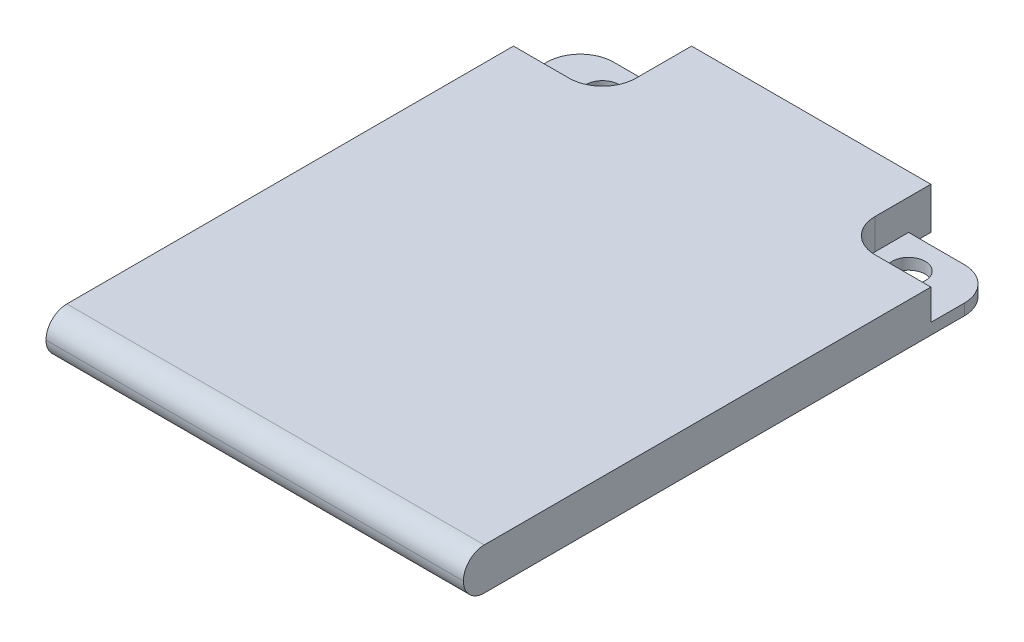
ISO-10303-21;
HEADER;
FILE_DESCRIPTION(('STEP AP214'),'2;1');
FILE_NAME('part.step','',(''),(''),'','','');
FILE_SCHEMA(('AUTOMOTIVE_DESIGN { 1 0 10303 214 1 1 1 1 }'));
ENDSEC;
DATA;
#1=APPLICATION_CONTEXT('core data for automotive mechanical design processes');
#2=APPLICATION_PROTOCOL_DEFINITION('international standard','automotive_design',2000,#1);
#3=PRODUCT_CONTEXT('',#1,'mechanical');
#4=PRODUCT('Part','Part','',(#3));
#5=PRODUCT_RELATED_PRODUCT_CATEGORY('part','',(#4));
#6=PRODUCT_DEFINITION_FORMATION('','',#4);
#7=PRODUCT_DEFINITION_CONTEXT('part definition',#1,'design');
#8=PRODUCT_DEFINITION('design','',#6,#7);
#9=PRODUCT_DEFINITION_SHAPE('','',#8);
#10=(LENGTH_UNIT() NAMED_UNIT(*) SI_UNIT(.MILLI.,.METRE.));
#11=(NAMED_UNIT(*) PLANE_ANGLE_UNIT() SI_UNIT($,.RADIAN.));
#12=(NAMED_UNIT(*) SI_UNIT($,.STERADIAN.) SOLID_ANGLE_UNIT());
#13=UNCERTAINTY_MEASURE_WITH_UNIT(LENGTH_MEASURE(1.E-05),#10,'distance_accuracy_value','');
#14=(GEOMETRIC_REPRESENTATION_CONTEXT(3) GLOBAL_UNCERTAINTY_ASSIGNED_CONTEXT((#13)) GLOBAL_UNIT_ASSIGNED_CONTEXT((#10,
#11,#12)) REPRESENTATION_CONTEXT('',''));
#15=CARTESIAN_POINT('',(0.,0.,0.));
#16=DIRECTION('',(0.,0.,1.));
#17=DIRECTION('',(1.,0.,0.));
#18=AXIS2_PLACEMENT_3D('',#15,#16,#17);
#19=CARTESIAN_POINT('',(37.5,3.75,-48.));
#20=DIRECTION('',(0.,0.,1.));
#21=DIRECTION('',(1.,0.,0.));
#22=AXIS2_PLACEMENT_3D('',#19,#20,#21);
#23=PLANE('',#22);
#24=DIRECTION('',(-1.,0.,0.));
#25=VECTOR('',#24,1.);
#26=CARTESIAN_POINT('',(29.5,1.,-48.));
#27=LINE('',#26,#25);
#28=CARTESIAN_POINT('',(34.5,1.,-48.));
#29=VERTEX_POINT('',#28);
#30=CARTESIAN_POINT('',(29.5,1.,-48.));
#31=VERTEX_POINT('',#30);
#32=EDGE_CURVE('E164',#29,#31,#27,.T.);
#33=ORIENTED_EDGE('',*,*,#32,.F.);
#34=DIRECTION('',(0.,-1.,0.));
#35=VECTOR('',#34,1.);
#36=CARTESIAN_POINT('',(34.5,3.75,-48.));
#37=LINE('',#36,#35);
#38=CARTESIAN_POINT('',(34.5,0.,-48.));
#39=VERTEX_POINT('',#38);
#40=EDGE_CURVE('E275',#29,#39,#37,.T.);
#41=ORIENTED_EDGE('',*,*,#40,.T.);
#42=DIRECTION('',(-1.,0.,0.));
#43=VECTOR('',#42,1.);
#44=CARTESIAN_POINT('',(37.5,0.,-48.));
#45=LINE('',#44,#43);
#46=CARTESIAN_POINT('',(29.5,0.,-48.));
#47=VERTEX_POINT('',#46);
#48=EDGE_CURVE('E242',#39,#47,#45,.T.);
#49=ORIENTED_EDGE('',*,*,#48,.T.);
#50=DIRECTION('',(0.,-1.,0.));
#51=VECTOR('',#50,1.);
#52=CARTESIAN_POINT('',(29.5,3.75,-48.));
#53=LINE('',#52,#51);
#54=EDGE_CURVE('E259',#31,#47,#53,.T.);
#55=ORIENTED_EDGE('',*,*,#54,.F.);
#56=EDGE_LOOP('',(#33,#41,#49,#55));
#57=FACE_BOUND('',#56,.T.);
#58=ADVANCED_FACE('F33',(#57),#23,.F.);
#59=CARTESIAN_POINT('',(32.5,3.75,-45.));
#60=DIRECTION('',(0.,-1.,0.));
#61=DIRECTION('',(0.,0.,-1.));
#62=AXIS2_PLACEMENT_3D('',#59,#60,#61);
#63=CYLINDRICAL_SURFACE('',#62,1.5);
#64=CARTESIAN_POINT('',(32.5,0.,-45.));
#65=DIRECTION('',(0.,1.,0.));
#66=DIRECTION('',(0.,0.,1.));
#67=AXIS2_PLACEMENT_3D('',#64,#65,#66);
#68=CIRCLE('',#67,1.5);
#69=CARTESIAN_POINT('',(32.5,0.,-43.5));
#70=VERTEX_POINT('',#69);
#71=EDGE_CURVE('E218',#70,#70,#68,.T.);
#72=ORIENTED_EDGE('',*,*,#71,.F.);
#73=EDGE_LOOP('',(#72));
#74=FACE_BOUND('',#73,.T.);
#75=CARTESIAN_POINT('',(32.5,1.,-45.));
#76=DIRECTION('',(0.,1.,0.));
#77=DIRECTION('',(0.,0.,1.));
#78=AXIS2_PLACEMENT_3D('',#75,#76,#77);
#79=CIRCLE('',#78,1.5);
#80=CARTESIAN_POINT('',(32.5,1.,-43.5));
#81=VERTEX_POINT('',#80);
#82=EDGE_CURVE('E190',#81,#81,#79,.T.);
#83=ORIENTED_EDGE('',*,*,#82,.T.);
#84=EDGE_LOOP('',(#83));
#85=FACE_BOUND('',#84,.T.);
#86=ADVANCED_FACE('F360',(#74,#85),#63,.F.);
#87=CARTESIAN_POINT('',(0.,3.75,0.));
#88=DIRECTION('',(0.,1.,0.));
#89=DIRECTION('',(0.,0.,1.));
#90=AXIS2_PLACEMENT_3D('',#87,#88,#89);
#91=PLANE('',#90);
#92=CARTESIAN_POINT('',(32.5,3.75,-45.));
#93=DIRECTION('',(0.,1.,0.));
#94=DIRECTION('',(0.,0.,1.));
#95=AXIS2_PLACEMENT_3D('',#92,#93,#94);
#96=CIRCLE('',#95,3.);
#97=CARTESIAN_POINT('',(29.5,3.75,-45.));
#98=VERTEX_POINT('',#97);
#99=CARTESIAN_POINT('',(32.5,3.75,-42.));
#100=VERTEX_POINT('',#99);
#101=EDGE_CURVE('E179',#98,#100,#96,.T.);
#102=ORIENTED_EDGE('',*,*,#101,.F.);
#103=DIRECTION('',(0.,0.,-1.));
#104=VECTOR('',#103,1.);
#105=CARTESIAN_POINT('',(29.5,3.75,-48.));
#106=LINE('',#105,#104);
#107=CARTESIAN_POINT('',(29.5,3.75,-50.));
#108=VERTEX_POINT('',#107);
#109=EDGE_CURVE('E159',#98,#108,#106,.T.);
#110=ORIENTED_EDGE('',*,*,#109,.T.);
#111=DIRECTION('',(-1.,0.,0.));
#112=VECTOR('',#111,1.);
#113=CARTESIAN_POINT('',(29.5,3.75,-50.));
#114=LINE('',#113,#112);
#115=CARTESIAN_POINT('',(8.,3.75,-50.));
#116=VERTEX_POINT('',#115);
#117=EDGE_CURVE('E233',#108,#116,#114,.T.);
#118=ORIENTED_EDGE('',*,*,#117,.T.);
#119=DIRECTION('',(0.,0.,1.));
#120=VECTOR('',#119,1.);
#121=CARTESIAN_POINT('',(8.,3.75,-50.));
#122=LINE('',#121,#120);
#123=CARTESIAN_POINT('',(8.,3.75,-45.));
#124=VERTEX_POINT('',#123);
#125=EDGE_CURVE('E235',#116,#124,#122,.T.);
#126=ORIENTED_EDGE('',*,*,#125,.T.);
#127=CARTESIAN_POINT('',(5.,3.75,-45.));
#128=DIRECTION('',(0.,1.,0.));
#129=DIRECTION('',(0.,0.,-1.));
#130=AXIS2_PLACEMENT_3D('',#127,#128,#129);
#131=CIRCLE('',#130,3.);
#132=CARTESIAN_POINT('',(4.99999999999998,3.75,-42.));
#133=VERTEX_POINT('',#132);
#134=EDGE_CURVE('E195',#133,#124,#131,.T.);
#135=ORIENTED_EDGE('',*,*,#134,.F.);
#136=DIRECTION('',(1.,0.,0.));
#137=VECTOR('',#136,1.);
#138=CARTESIAN_POINT('',(4.99999999999998,3.75,-42.));
#139=LINE('',#138,#137);
#140=CARTESIAN_POINT('',(0.,3.75,-42.));
#141=VERTEX_POINT('',#140);
#142=EDGE_CURVE('E206',#141,#133,#139,.T.);
#143=ORIENTED_EDGE('',*,*,#142,.F.);
#144=DIRECTION('',(0.,0.,1.));
#145=VECTOR('',#144,1.);
#146=CARTESIAN_POINT('',(0.,3.75,-48.));
#147=LINE('',#146,#145);
#148=CARTESIAN_POINT('',(0.,3.75,-1.875));
#149=VERTEX_POINT('',#148);
#150=EDGE_CURVE('E226',#141,#149,#147,.T.);
#151=ORIENTED_EDGE('',*,*,#150,.T.);
#152=DIRECTION('',(1.,0.,0.));
#153=VECTOR('',#152,1.);
#154=CARTESIAN_POINT('',(37.5,3.75,-1.875));
#155=LINE('',#154,#153);
#156=CARTESIAN_POINT('',(37.5,3.75,-1.875));
#157=VERTEX_POINT('',#156);
#158=EDGE_CURVE('E273',#149,#157,#155,.T.);
#159=ORIENTED_EDGE('',*,*,#158,.T.);
#160=DIRECTION('',(0.,0.,-1.));
#161=VECTOR('',#160,1.);
#162=CARTESIAN_POINT('',(37.5,3.75,0.));
#163=LINE('',#162,#161);
#164=CARTESIAN_POINT('',(37.5,3.75,-42.));
#165=VERTEX_POINT('',#164);
#166=EDGE_CURVE('E228',#157,#165,#163,.T.);
#167=ORIENTED_EDGE('',*,*,#166,.T.);
#168=DIRECTION('',(1.,0.,0.));
#169=VECTOR('',#168,1.);
#170=CARTESIAN_POINT('',(32.5,3.75,-42.));
#171=LINE('',#170,#169);
#172=EDGE_CURVE('E177',#100,#165,#171,.T.);
#173=ORIENTED_EDGE('',*,*,#172,.F.);
#174=EDGE_LOOP('',(#102,#110,#118,#126,#135,#143,#151,#159,#167,#173));
#175=FACE_BOUND('',#174,.T.);
#176=ADVANCED_FACE('F320',(#175),#91,.T.);
#177=CARTESIAN_POINT('',(0.,0.,0.));
#178=DIRECTION('',(0.,1.,0.));
#179=DIRECTION('',(0.,0.,1.));
#180=AXIS2_PLACEMENT_3D('',#177,#178,#179);
#181=PLANE('',#180);
#182=CARTESIAN_POINT('',(5.,0.,-45.));
#183=DIRECTION('',(0.,1.,0.));
#184=DIRECTION('',(0.,0.,1.));
#185=AXIS2_PLACEMENT_3D('',#182,#183,#184);
#186=CIRCLE('',#185,1.5);
#187=CARTESIAN_POINT('',(5.,0.,-43.5));
#188=VERTEX_POINT('',#187);
#189=EDGE_CURVE('E221',#188,#188,#186,.T.);
#190=ORIENTED_EDGE('',*,*,#189,.T.);
#191=EDGE_LOOP('',(#190));
#192=FACE_BOUND('',#191,.T.);
#193=ORIENTED_EDGE('',*,*,#48,.F.);
#194=CARTESIAN_POINT('',(34.5,0.,-45.));
#195=DIRECTION('',(0.,1.,0.));
#196=DIRECTION('',(0.,0.,1.));
#197=AXIS2_PLACEMENT_3D('',#194,#195,#196);
#198=CIRCLE('',#197,3.);
#199=CARTESIAN_POINT('',(37.5,0.,-45.));
#200=VERTEX_POINT('',#199);
#201=EDGE_CURVE('E286',#39,#200,#198,.F.);
#202=ORIENTED_EDGE('',*,*,#201,.T.);
#203=DIRECTION('',(0.,0.,-1.));
#204=VECTOR('',#203,1.);
#205=CARTESIAN_POINT('',(37.5,0.,0.));
#206=LINE('',#205,#204);
#207=CARTESIAN_POINT('',(37.5,0.,-1.875));
#208=VERTEX_POINT('',#207);
#209=EDGE_CURVE('E239',#208,#200,#206,.T.);
#210=ORIENTED_EDGE('',*,*,#209,.F.);
#211=DIRECTION('',(1.,0.,0.));
#212=VECTOR('',#211,1.);
#213=CARTESIAN_POINT('',(0.,0.,-1.875));
#214=LINE('',#213,#212);
#215=CARTESIAN_POINT('',(0.,0.,-1.875));
#216=VERTEX_POINT('',#215);
#217=EDGE_CURVE('E265',#208,#216,#214,.F.);
#218=ORIENTED_EDGE('',*,*,#217,.T.);
#219=DIRECTION('',(0.,0.,1.));
#220=VECTOR('',#219,1.);
#221=CARTESIAN_POINT('',(0.,0.,-48.));
#222=LINE('',#221,#220);
#223=CARTESIAN_POINT('',(0.,0.,-45.));
#224=VERTEX_POINT('',#223);
#225=EDGE_CURVE('E225',#224,#216,#222,.T.);
#226=ORIENTED_EDGE('',*,*,#225,.F.);
#227=CARTESIAN_POINT('',(3.,0.,-45.));
#228=DIRECTION('',(0.,1.,0.));
#229=DIRECTION('',(0.,0.,1.));
#230=AXIS2_PLACEMENT_3D('',#227,#228,#229);
#231=CIRCLE('',#230,3.);
#232=CARTESIAN_POINT('',(3.,0.,-48.));
#233=VERTEX_POINT('',#232);
#234=EDGE_CURVE('E284',#224,#233,#231,.F.);
#235=ORIENTED_EDGE('',*,*,#234,.T.);
#236=DIRECTION('',(-1.,0.,0.));
#237=VECTOR('',#236,1.);
#238=CARTESIAN_POINT('',(8.,0.,-48.));
#239=LINE('',#238,#237);
#240=CARTESIAN_POINT('',(8.,0.,-48.));
#241=VERTEX_POINT('',#240);
#242=EDGE_CURVE('E229',#241,#233,#239,.T.);
#243=ORIENTED_EDGE('',*,*,#242,.F.);
#244=DIRECTION('',(0.,0.,1.));
#245=VECTOR('',#244,1.);
#246=CARTESIAN_POINT('',(8.,0.,-50.));
#247=LINE('',#246,#245);
#248=CARTESIAN_POINT('',(8.,0.,-50.));
#249=VERTEX_POINT('',#248);
#250=EDGE_CURVE('E248',#249,#241,#247,.T.);
#251=ORIENTED_EDGE('',*,*,#250,.F.);
#252=DIRECTION('',(-1.,0.,0.));
#253=VECTOR('',#252,1.);
#254=CARTESIAN_POINT('',(29.5,0.,-50.));
#255=LINE('',#254,#253);
#256=CARTESIAN_POINT('',(29.5,0.,-50.));
#257=VERTEX_POINT('',#256);
#258=EDGE_CURVE('E246',#257,#249,#255,.T.);
#259=ORIENTED_EDGE('',*,*,#258,.F.);
#260=DIRECTION('',(0.,0.,-1.));
#261=VECTOR('',#260,1.);
#262=CARTESIAN_POINT('',(29.5,0.,-48.));
#263=LINE('',#262,#261);
#264=EDGE_CURVE('E244',#47,#257,#263,.T.);
#265=ORIENTED_EDGE('',*,*,#264,.F.);
#266=EDGE_LOOP('',(#193,#202,#210,#218,#226,#235,#243,#251,#259,#265));
#267=FACE_BOUND('',#266,.T.);
#268=ORIENTED_EDGE('',*,*,#71,.T.);
#269=EDGE_LOOP('',(#268));
#270=FACE_BOUND('',#269,.T.);
#271=ADVANCED_FACE('F303',(#192,#267,#270),#181,.F.);
#272=CARTESIAN_POINT('',(0.,3.75,-48.));
#273=DIRECTION('',(1.,0.,0.));
#274=DIRECTION('',(0.,0.,-1.));
#275=AXIS2_PLACEMENT_3D('',#272,#273,#274);
#276=PLANE('',#275);
#277=DIRECTION('',(0.,0.,1.));
#278=VECTOR('',#277,1.);
#279=CARTESIAN_POINT('',(0.,1.,-48.));
#280=LINE('',#279,#278);
#281=CARTESIAN_POINT('',(0.,1.,-45.));
#282=VERTEX_POINT('',#281);
#283=CARTESIAN_POINT('',(0.,1.,-42.));
#284=VERTEX_POINT('',#283);
#285=EDGE_CURVE('E197',#282,#284,#280,.T.);
#286=ORIENTED_EDGE('',*,*,#285,.F.);
#287=DIRECTION('',(0.,-1.,0.));
#288=VECTOR('',#287,1.);
#289=CARTESIAN_POINT('',(0.,3.75,-45.));
#290=LINE('',#289,#288);
#291=EDGE_CURVE('E292',#282,#224,#290,.T.);
#292=ORIENTED_EDGE('',*,*,#291,.T.);
#293=ORIENTED_EDGE('',*,*,#225,.T.);
#294=CARTESIAN_POINT('',(0.,1.875,-1.875));
#295=DIRECTION('',(1.,0.,0.));
#296=DIRECTION('',(0.,0.,-1.));
#297=AXIS2_PLACEMENT_3D('',#294,#295,#296);
#298=CIRCLE('',#297,1.875);
#299=CARTESIAN_POINT('',(0.,1.875,0.));
#300=VERTEX_POINT('',#299);
#301=EDGE_CURVE('E271',#216,#300,#298,.F.);
#302=ORIENTED_EDGE('',*,*,#301,.T.);
#303=CARTESIAN_POINT('',(0.,1.875,-1.875));
#304=DIRECTION('',(1.,0.,0.));
#305=DIRECTION('',(0.,0.,-1.));
#306=AXIS2_PLACEMENT_3D('',#303,#304,#305);
#307=CIRCLE('',#306,1.875);
#308=EDGE_CURVE('E268',#300,#149,#307,.F.);
#309=ORIENTED_EDGE('',*,*,#308,.T.);
#310=ORIENTED_EDGE('',*,*,#150,.F.);
#311=DIRECTION('',(0.,1.,0.));
#312=VECTOR('',#311,1.);
#313=CARTESIAN_POINT('',(0.,1.,-42.));
#314=LINE('',#313,#312);
#315=EDGE_CURVE('E205',#284,#141,#314,.T.);
#316=ORIENTED_EDGE('',*,*,#315,.F.);
#317=EDGE_LOOP('',(#286,#292,#293,#302,#309,#310,#316));
#318=FACE_BOUND('',#317,.T.);
#319=ADVANCED_FACE('F297',(#318),#276,.F.);
#320=CARTESIAN_POINT('',(37.5,3.75,0.));
#321=DIRECTION('',(-1.,0.,0.));
#322=DIRECTION('',(0.,0.,1.));
#323=AXIS2_PLACEMENT_3D('',#320,#321,#322);
#324=PLANE('',#323);
#325=ORIENTED_EDGE('',*,*,#209,.T.);
#326=DIRECTION('',(0.,-1.,0.));
#327=VECTOR('',#326,1.);
#328=CARTESIAN_POINT('',(37.5,3.75,-45.));
#329=LINE('',#328,#327);
#330=CARTESIAN_POINT('',(37.5,1.,-45.));
#331=VERTEX_POINT('',#330);
#332=EDGE_CURVE('E288',#200,#331,#329,.F.);
#333=ORIENTED_EDGE('',*,*,#332,.T.);
#334=DIRECTION('',(0.,0.,-1.));
#335=VECTOR('',#334,1.);
#336=CARTESIAN_POINT('',(37.5,1.,-48.));
#337=LINE('',#336,#335);
#338=CARTESIAN_POINT('',(37.5,1.,-42.));
#339=VERTEX_POINT('',#338);
#340=EDGE_CURVE('E183',#339,#331,#337,.T.);
#341=ORIENTED_EDGE('',*,*,#340,.F.);
#342=DIRECTION('',(0.,1.,0.));
#343=VECTOR('',#342,1.);
#344=CARTESIAN_POINT('',(37.5,1.,-42.));
#345=LINE('',#344,#343);
#346=EDGE_CURVE('E187',#339,#165,#345,.T.);
#347=ORIENTED_EDGE('',*,*,#346,.T.);
#348=ORIENTED_EDGE('',*,*,#166,.F.);
#349=CARTESIAN_POINT('',(37.5,1.875,-1.875));
#350=DIRECTION('',(-1.,0.,0.));
#351=DIRECTION('',(0.,0.,1.));
#352=AXIS2_PLACEMENT_3D('',#349,#350,#351);
#353=CIRCLE('',#352,1.875);
#354=CARTESIAN_POINT('',(37.5,1.875,0.));
#355=VERTEX_POINT('',#354);
#356=EDGE_CURVE('E261',#157,#355,#353,.F.);
#357=ORIENTED_EDGE('',*,*,#356,.T.);
#358=CARTESIAN_POINT('',(37.5,1.875,-1.875));
#359=DIRECTION('',(-1.,0.,0.));
#360=DIRECTION('',(0.,0.,1.));
#361=AXIS2_PLACEMENT_3D('',#358,#359,#360);
#362=CIRCLE('',#361,1.875);
#363=EDGE_CURVE('E263',#355,#208,#362,.F.);
#364=ORIENTED_EDGE('',*,*,#363,.T.);
#365=EDGE_LOOP('',(#325,#333,#341,#347,#348,#357,#364));
#366=FACE_BOUND('',#365,.T.);
#367=ADVANCED_FACE('F324',(#366),#324,.F.);
#368=CARTESIAN_POINT('',(29.5,3.75,-48.));
#369=DIRECTION('',(-1.,0.,0.));
#370=DIRECTION('',(0.,0.,1.));
#371=AXIS2_PLACEMENT_3D('',#368,#369,#370);
#372=PLANE('',#371);
#373=ORIENTED_EDGE('',*,*,#264,.T.);
#374=DIRECTION('',(0.,-1.,0.));
#375=VECTOR('',#374,1.);
#376=CARTESIAN_POINT('',(29.5,3.75,-50.));
#377=LINE('',#376,#375);
#378=EDGE_CURVE('E256',#108,#257,#377,.T.);
#379=ORIENTED_EDGE('',*,*,#378,.F.);
#380=ORIENTED_EDGE('',*,*,#109,.F.);
#381=DIRECTION('',(0.,1.,0.));
#382=VECTOR('',#381,1.);
#383=CARTESIAN_POINT('',(29.5,1.,-45.));
#384=LINE('',#383,#382);
#385=CARTESIAN_POINT('',(29.5,1.,-45.));
#386=VERTEX_POINT('',#385);
#387=EDGE_CURVE('E151',#386,#98,#384,.T.);
#388=ORIENTED_EDGE('',*,*,#387,.F.);
#389=DIRECTION('',(0.,0.,1.));
#390=VECTOR('',#389,1.);
#391=CARTESIAN_POINT('',(29.5,1.,-48.));
#392=LINE('',#391,#390);
#393=EDGE_CURVE('E156',#31,#386,#392,.T.);
#394=ORIENTED_EDGE('',*,*,#393,.F.);
#395=ORIENTED_EDGE('',*,*,#54,.T.);
#396=EDGE_LOOP('',(#373,#379,#380,#388,#394,#395));
#397=FACE_BOUND('',#396,.T.);
#398=ADVANCED_FACE('F153',(#397),#372,.F.);
#399=CARTESIAN_POINT('',(29.5,3.75,-50.));
#400=DIRECTION('',(0.,0.,1.));
#401=DIRECTION('',(1.,0.,0.));
#402=AXIS2_PLACEMENT_3D('',#399,#400,#401);
#403=PLANE('',#402);
#404=ORIENTED_EDGE('',*,*,#258,.T.);
#405=DIRECTION('',(0.,-1.,0.));
#406=VECTOR('',#405,1.);
#407=CARTESIAN_POINT('',(8.,3.75,-50.));
#408=LINE('',#407,#406);
#409=EDGE_CURVE('E253',#116,#249,#408,.T.);
#410=ORIENTED_EDGE('',*,*,#409,.F.);
#411=ORIENTED_EDGE('',*,*,#117,.F.);
#412=ORIENTED_EDGE('',*,*,#378,.T.);
#413=EDGE_LOOP('',(#404,#410,#411,#412));
#414=FACE_BOUND('',#413,.T.);
#415=ADVANCED_FACE('F339',(#414),#403,.F.);
#416=CARTESIAN_POINT('',(8.,3.75,-50.));
#417=DIRECTION('',(1.,0.,0.));
#418=DIRECTION('',(0.,0.,-1.));
#419=AXIS2_PLACEMENT_3D('',#416,#417,#418);
#420=PLANE('',#419);
#421=ORIENTED_EDGE('',*,*,#250,.T.);
#422=DIRECTION('',(0.,-1.,0.));
#423=VECTOR('',#422,1.);
#424=CARTESIAN_POINT('',(8.,3.75,-48.));
#425=LINE('',#424,#423);
#426=CARTESIAN_POINT('',(8.,1.,-48.));
#427=VERTEX_POINT('',#426);
#428=EDGE_CURVE('E237',#427,#241,#425,.T.);
#429=ORIENTED_EDGE('',*,*,#428,.F.);
#430=DIRECTION('',(0.,0.,-1.));
#431=VECTOR('',#430,1.);
#432=CARTESIAN_POINT('',(8.,1.,-48.));
#433=LINE('',#432,#431);
#434=CARTESIAN_POINT('',(8.,1.,-45.));
#435=VERTEX_POINT('',#434);
#436=EDGE_CURVE('E192',#435,#427,#433,.T.);
#437=ORIENTED_EDGE('',*,*,#436,.F.);
#438=DIRECTION('',(0.,1.,0.));
#439=VECTOR('',#438,1.);
#440=CARTESIAN_POINT('',(8.,1.,-45.));
#441=LINE('',#440,#439);
#442=EDGE_CURVE('E211',#435,#124,#441,.T.);
#443=ORIENTED_EDGE('',*,*,#442,.T.);
#444=ORIENTED_EDGE('',*,*,#125,.F.);
#445=ORIENTED_EDGE('',*,*,#409,.T.);
#446=EDGE_LOOP('',(#421,#429,#437,#443,#444,#445));
#447=FACE_BOUND('',#446,.T.);
#448=ADVANCED_FACE('F345',(#447),#420,.F.);
#449=CARTESIAN_POINT('',(8.,3.75,-48.));
#450=DIRECTION('',(0.,0.,1.));
#451=DIRECTION('',(1.,0.,0.));
#452=AXIS2_PLACEMENT_3D('',#449,#450,#451);
#453=PLANE('',#452);
#454=ORIENTED_EDGE('',*,*,#242,.T.);
#455=DIRECTION('',(0.,-1.,0.));
#456=VECTOR('',#455,1.);
#457=CARTESIAN_POINT('',(3.,3.75,-48.));
#458=LINE('',#457,#456);
#459=CARTESIAN_POINT('',(3.,1.,-48.));
#460=VERTEX_POINT('',#459);
#461=EDGE_CURVE('E41',#233,#460,#458,.F.);
#462=ORIENTED_EDGE('',*,*,#461,.T.);
#463=DIRECTION('',(-1.,0.,0.));
#464=VECTOR('',#463,1.);
#465=CARTESIAN_POINT('',(8.,1.,-48.));
#466=LINE('',#465,#464);
#467=EDGE_CURVE('E194',#427,#460,#466,.T.);
#468=ORIENTED_EDGE('',*,*,#467,.F.);
#469=ORIENTED_EDGE('',*,*,#428,.T.);
#470=EDGE_LOOP('',(#454,#462,#468,#469));
#471=FACE_BOUND('',#470,.T.);
#472=ADVANCED_FACE('F354',(#471),#453,.F.);
#473=CARTESIAN_POINT('',(5.,3.75,-45.));
#474=DIRECTION('',(0.,-1.,0.));
#475=DIRECTION('',(0.,0.,-1.));
#476=AXIS2_PLACEMENT_3D('',#473,#474,#475);
#477=CYLINDRICAL_SURFACE('',#476,1.5);
#478=CARTESIAN_POINT('',(5.,1.,-45.));
#479=DIRECTION('',(0.,-1.,0.));
#480=DIRECTION('',(0.,0.,-1.));
#481=AXIS2_PLACEMENT_3D('',#478,#479,#480);
#482=CIRCLE('',#481,1.5);
#483=CARTESIAN_POINT('',(5.,1.,-46.5));
#484=VERTEX_POINT('',#483);
#485=EDGE_CURVE('E214',#484,#484,#482,.T.);
#486=ORIENTED_EDGE('',*,*,#485,.F.);
#487=EDGE_LOOP('',(#486));
#488=FACE_BOUND('',#487,.T.);
#489=ORIENTED_EDGE('',*,*,#189,.F.);
#490=EDGE_LOOP('',(#489));
#491=FACE_BOUND('',#490,.T.);
#492=ADVANCED_FACE('F377',(#488,#491),#477,.F.);
#493=CARTESIAN_POINT('',(0.,1.875,-1.875));
#494=DIRECTION('',(-1.,0.,0.));
#495=DIRECTION('',(0.,0.,1.));
#496=AXIS2_PLACEMENT_3D('',#493,#494,#495);
#497=CYLINDRICAL_SURFACE('',#496,1.875);
#498=ORIENTED_EDGE('',*,*,#158,.F.);
#499=ORIENTED_EDGE('',*,*,#308,.F.);
#500=DIRECTION('',(1.,0.,0.));
#501=VECTOR('',#500,1.);
#502=CARTESIAN_POINT('',(0.,1.875,0.));
#503=LINE('',#502,#501);
#504=EDGE_CURVE('E222',#355,#300,#503,.F.);
#505=ORIENTED_EDGE('',*,*,#504,.F.);
#506=ORIENTED_EDGE('',*,*,#356,.F.);
#507=EDGE_LOOP('',(#498,#499,#505,#506));
#508=FACE_BOUND('',#507,.T.);
#509=ADVANCED_FACE('F316',(#508),#497,.T.);
#510=CARTESIAN_POINT('',(0.,1.875,-1.875));
#511=DIRECTION('',(1.,0.,0.));
#512=DIRECTION('',(0.,0.,-1.));
#513=AXIS2_PLACEMENT_3D('',#510,#511,#512);
#514=CYLINDRICAL_SURFACE('',#513,1.875);
#515=ORIENTED_EDGE('',*,*,#301,.F.);
#516=ORIENTED_EDGE('',*,*,#217,.F.);
#517=ORIENTED_EDGE('',*,*,#363,.F.);
#518=ORIENTED_EDGE('',*,*,#504,.T.);
#519=EDGE_LOOP('',(#515,#516,#517,#518));
#520=FACE_BOUND('',#519,.T.);
#521=ADVANCED_FACE('F310',(#520),#514,.T.);
#522=CARTESIAN_POINT('',(5.,1.,-45.));
#523=DIRECTION('',(0.,1.,0.));
#524=DIRECTION('',(0.,0.,1.));
#525=AXIS2_PLACEMENT_3D('',#522,#523,#524);
#526=CYLINDRICAL_SURFACE('',#525,3.);
#527=ORIENTED_EDGE('',*,*,#134,.T.);
#528=ORIENTED_EDGE('',*,*,#442,.F.);
#529=CARTESIAN_POINT('',(5.,1.,-45.));
#530=DIRECTION('',(0.,1.,0.));
#531=DIRECTION('',(0.,0.,-1.));
#532=AXIS2_PLACEMENT_3D('',#529,#530,#531);
#533=CIRCLE('',#532,3.);
#534=CARTESIAN_POINT('',(4.99999999999998,1.,-42.));
#535=VERTEX_POINT('',#534);
#536=EDGE_CURVE('E202',#535,#435,#533,.T.);
#537=ORIENTED_EDGE('',*,*,#536,.F.);
#538=DIRECTION('',(0.,1.,0.));
#539=VECTOR('',#538,1.);
#540=CARTESIAN_POINT('',(4.99999999999998,1.,-42.));
#541=LINE('',#540,#539);
#542=EDGE_CURVE('E215',#535,#133,#541,.T.);
#543=ORIENTED_EDGE('',*,*,#542,.T.);
#544=EDGE_LOOP('',(#527,#528,#537,#543));
#545=FACE_BOUND('',#544,.T.);
#546=ADVANCED_FACE('F349',(#545),#526,.F.);
#547=CARTESIAN_POINT('',(4.99999999999998,1.,-42.));
#548=DIRECTION('',(0.,0.,1.));
#549=DIRECTION('',(1.,0.,0.));
#550=AXIS2_PLACEMENT_3D('',#547,#548,#549);
#551=PLANE('',#550);
#552=ORIENTED_EDGE('',*,*,#142,.T.);
#553=ORIENTED_EDGE('',*,*,#542,.F.);
#554=DIRECTION('',(1.,0.,0.));
#555=VECTOR('',#554,1.);
#556=CARTESIAN_POINT('',(4.99999999999998,1.,-42.));
#557=LINE('',#556,#555);
#558=EDGE_CURVE('E199',#284,#535,#557,.T.);
#559=ORIENTED_EDGE('',*,*,#558,.F.);
#560=ORIENTED_EDGE('',*,*,#315,.T.);
#561=EDGE_LOOP('',(#552,#553,#559,#560));
#562=FACE_BOUND('',#561,.T.);
#563=ADVANCED_FACE('F352',(#562),#551,.F.);
#564=CARTESIAN_POINT('',(5.,1.,-45.));
#565=DIRECTION('',(0.,-1.,0.));
#566=DIRECTION('',(0.,0.,-1.));
#567=AXIS2_PLACEMENT_3D('',#564,#565,#566);
#568=PLANE('',#567);
#569=ORIENTED_EDGE('',*,*,#485,.T.);
#570=EDGE_LOOP('',(#569));
#571=FACE_BOUND('',#570,.T.);
#572=ORIENTED_EDGE('',*,*,#467,.T.);
#573=CARTESIAN_POINT('',(3.,1.,-45.));
#574=DIRECTION('',(0.,-1.,0.));
#575=DIRECTION('',(0.,0.,-1.));
#576=AXIS2_PLACEMENT_3D('',#573,#574,#575);
#577=CIRCLE('',#576,3.);
#578=EDGE_CURVE('E11',#460,#282,#577,.F.);
#579=ORIENTED_EDGE('',*,*,#578,.T.);
#580=ORIENTED_EDGE('',*,*,#285,.T.);
#581=ORIENTED_EDGE('',*,*,#558,.T.);
#582=ORIENTED_EDGE('',*,*,#536,.T.);
#583=ORIENTED_EDGE('',*,*,#436,.T.);
#584=EDGE_LOOP('',(#572,#579,#580,#581,#582,#583));
#585=FACE_BOUND('',#584,.T.);
#586=ADVANCED_FACE('F353',(#571,#585),#568,.F.);
#587=CARTESIAN_POINT('',(32.5,1.,-42.));
#588=DIRECTION('',(0.,0.,1.));
#589=DIRECTION('',(1.,0.,0.));
#590=AXIS2_PLACEMENT_3D('',#587,#588,#589);
#591=PLANE('',#590);
#592=ORIENTED_EDGE('',*,*,#172,.T.);
#593=ORIENTED_EDGE('',*,*,#346,.F.);
#594=DIRECTION('',(1.,0.,0.));
#595=VECTOR('',#594,1.);
#596=CARTESIAN_POINT('',(32.5,1.,-42.));
#597=LINE('',#596,#595);
#598=CARTESIAN_POINT('',(32.5,1.,-42.));
#599=VERTEX_POINT('',#598);
#600=EDGE_CURVE('E172',#599,#339,#597,.T.);
#601=ORIENTED_EDGE('',*,*,#600,.F.);
#602=DIRECTION('',(0.,1.,0.));
#603=VECTOR('',#602,1.);
#604=CARTESIAN_POINT('',(32.5,1.,-42.));
#605=LINE('',#604,#603);
#606=EDGE_CURVE('E163',#599,#100,#605,.T.);
#607=ORIENTED_EDGE('',*,*,#606,.T.);
#608=EDGE_LOOP('',(#592,#593,#601,#607));
#609=FACE_BOUND('',#608,.T.);
#610=ADVANCED_FACE('F327',(#609),#591,.F.);
#611=CARTESIAN_POINT('',(32.5,1.,-45.));
#612=DIRECTION('',(0.,1.,0.));
#613=DIRECTION('',(0.,0.,1.));
#614=AXIS2_PLACEMENT_3D('',#611,#612,#613);
#615=CYLINDRICAL_SURFACE('',#614,3.);
#616=ORIENTED_EDGE('',*,*,#101,.T.);
#617=ORIENTED_EDGE('',*,*,#606,.F.);
#618=CARTESIAN_POINT('',(32.5,1.,-45.));
#619=DIRECTION('',(0.,1.,0.));
#620=DIRECTION('',(0.,0.,1.));
#621=AXIS2_PLACEMENT_3D('',#618,#619,#620);
#622=CIRCLE('',#621,3.);
#623=EDGE_CURVE('E167',#386,#599,#622,.T.);
#624=ORIENTED_EDGE('',*,*,#623,.F.);
#625=ORIENTED_EDGE('',*,*,#387,.T.);
#626=EDGE_LOOP('',(#616,#617,#624,#625));
#627=FACE_BOUND('',#626,.T.);
#628=ADVANCED_FACE('F168',(#627),#615,.F.);
#629=CARTESIAN_POINT('',(32.5,1.,-45.));
#630=DIRECTION('',(0.,1.,0.));
#631=DIRECTION('',(0.,0.,1.));
#632=AXIS2_PLACEMENT_3D('',#629,#630,#631);
#633=PLANE('',#632);
#634=ORIENTED_EDGE('',*,*,#82,.F.);
#635=EDGE_LOOP('',(#634));
#636=FACE_BOUND('',#635,.T.);
#637=ORIENTED_EDGE('',*,*,#340,.T.);
#638=CARTESIAN_POINT('',(34.5,1.,-45.));
#639=DIRECTION('',(0.,1.,0.));
#640=DIRECTION('',(0.,0.,1.));
#641=AXIS2_PLACEMENT_3D('',#638,#639,#640);
#642=CIRCLE('',#641,3.);
#643=EDGE_CURVE('E290',#331,#29,#642,.T.);
#644=ORIENTED_EDGE('',*,*,#643,.T.);
#645=ORIENTED_EDGE('',*,*,#32,.T.);
#646=ORIENTED_EDGE('',*,*,#393,.T.);
#647=ORIENTED_EDGE('',*,*,#623,.T.);
#648=ORIENTED_EDGE('',*,*,#600,.T.);
#649=EDGE_LOOP('',(#637,#644,#645,#646,#647,#648));
#650=FACE_BOUND('',#649,.T.);
#651=ADVANCED_FACE('F175',(#636,#650),#633,.T.);
#652=CARTESIAN_POINT('',(34.5,3.75,-45.));
#653=DIRECTION('',(0.,-1.,0.));
#654=DIRECTION('',(0.,0.,-1.));
#655=AXIS2_PLACEMENT_3D('',#652,#653,#654);
#656=CYLINDRICAL_SURFACE('',#655,3.);
#657=ORIENTED_EDGE('',*,*,#643,.F.);
#658=ORIENTED_EDGE('',*,*,#332,.F.);
#659=ORIENTED_EDGE('',*,*,#201,.F.);
#660=ORIENTED_EDGE('',*,*,#40,.F.);
#661=EDGE_LOOP('',(#657,#658,#659,#660));
#662=FACE_BOUND('',#661,.T.);
#663=ADVANCED_FACE('F332',(#662),#656,.T.);
#664=CARTESIAN_POINT('',(3.,3.75,-45.));
#665=DIRECTION('',(0.,-1.,0.));
#666=DIRECTION('',(0.,0.,-1.));
#667=AXIS2_PLACEMENT_3D('',#664,#665,#666);
#668=CYLINDRICAL_SURFACE('',#667,3.);
#669=ORIENTED_EDGE('',*,*,#578,.F.);
#670=ORIENTED_EDGE('',*,*,#461,.F.);
#671=ORIENTED_EDGE('',*,*,#234,.F.);
#672=ORIENTED_EDGE('',*,*,#291,.F.);
#673=EDGE_LOOP('',(#669,#670,#671,#672));
#674=FACE_BOUND('',#673,.T.);
#675=ADVANCED_FACE('F35',(#674),#668,.T.);
#676=CLOSED_SHELL('',(#58,#86,#176,#271,#319,#367,#398,#415,#448,#472,#492,#509,#521,#546,#563,
#586,#610,#628,#651,#663,#675));
#677=MANIFOLD_SOLID_BREP('B2',#676);
#678=ADVANCED_BREP_SHAPE_REPRESENTATION('',(#18,#677),#14);
#679=SHAPE_DEFINITION_REPRESENTATION(#9,#678);
ENDSEC;
END-ISO-10303-21;
